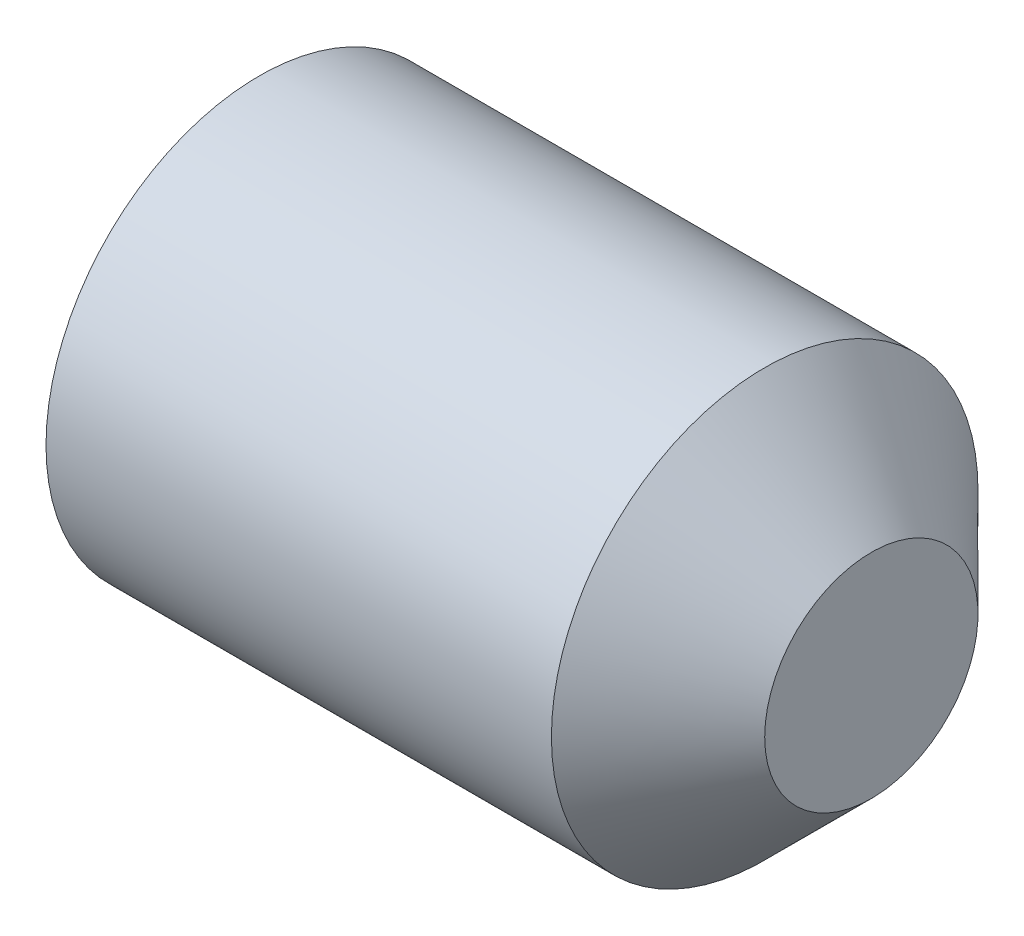
ISO-10303-21;
HEADER;
FILE_DESCRIPTION(('STEP AP214'),'2;1');
FILE_NAME('part.step','',(''),(''),'','','');
FILE_SCHEMA(('AUTOMOTIVE_DESIGN { 1 0 10303 214 1 1 1 1 }'));
ENDSEC;
DATA;
#1=APPLICATION_CONTEXT('core data for automotive mechanical design processes');
#2=APPLICATION_PROTOCOL_DEFINITION('international standard','automotive_design',2000,#1);
#3=PRODUCT_CONTEXT('',#1,'mechanical');
#4=PRODUCT('Part','Part','',(#3));
#5=PRODUCT_RELATED_PRODUCT_CATEGORY('part','',(#4));
#6=PRODUCT_DEFINITION_FORMATION('','',#4);
#7=PRODUCT_DEFINITION_CONTEXT('part definition',#1,'design');
#8=PRODUCT_DEFINITION('design','',#6,#7);
#9=PRODUCT_DEFINITION_SHAPE('','',#8);
#10=(LENGTH_UNIT() NAMED_UNIT(*) SI_UNIT(.MILLI.,.METRE.));
#11=(NAMED_UNIT(*) PLANE_ANGLE_UNIT() SI_UNIT($,.RADIAN.));
#12=(NAMED_UNIT(*) SI_UNIT($,.STERADIAN.) SOLID_ANGLE_UNIT());
#13=UNCERTAINTY_MEASURE_WITH_UNIT(LENGTH_MEASURE(1.E-05),#10,'distance_accuracy_value','');
#14=(GEOMETRIC_REPRESENTATION_CONTEXT(3) GLOBAL_UNCERTAINTY_ASSIGNED_CONTEXT((#13)) GLOBAL_UNIT_ASSIGNED_CONTEXT((#10,
#11,#12)) REPRESENTATION_CONTEXT('',''));
#15=CARTESIAN_POINT('',(0.,0.,0.));
#16=DIRECTION('',(0.,0.,1.));
#17=DIRECTION('',(1.,0.,0.));
#18=AXIS2_PLACEMENT_3D('',#15,#16,#17);
#19=CARTESIAN_POINT('',(0.,0.,0.));
#20=DIRECTION('',(-1.,0.,0.));
#21=DIRECTION('',(0.,0.,1.));
#22=AXIS2_PLACEMENT_3D('',#19,#20,#21);
#23=PLANE('',#22);
#24=CARTESIAN_POINT('',(0.,0.,0.));
#25=DIRECTION('',(-1.,0.,0.));
#26=DIRECTION('',(0.,0.,1.));
#27=AXIS2_PLACEMENT_3D('',#24,#25,#26);
#28=CIRCLE('',#27,0.774000000000001);
#29=CARTESIAN_POINT('',(0.,0.,0.774000000000001));
#30=VERTEX_POINT('',#29);
#31=EDGE_CURVE('E136',#30,#30,#28,.T.);
#32=ORIENTED_EDGE('',*,*,#31,.T.);
#33=EDGE_LOOP('',(#32));
#34=FACE_BOUND('',#33,.T.);
#35=DIRECTION('',(0.,0.,-1.));
#36=VECTOR('',#35,1.);
#37=CARTESIAN_POINT('',(0.,0.450000000000003,0.259807621135329));
#38=LINE('',#37,#36);
#39=CARTESIAN_POINT('',(0.,0.450000000000003,0.259807621135329));
#40=VERTEX_POINT('',#39);
#41=CARTESIAN_POINT('',(0.,0.450000000000003,-0.259807621135334));
#42=VERTEX_POINT('',#41);
#43=EDGE_CURVE('E127',#40,#42,#38,.T.);
#44=ORIENTED_EDGE('',*,*,#43,.F.);
#45=DIRECTION('',(0.,-0.866025403784439,0.5));
#46=VECTOR('',#45,1.);
#47=CARTESIAN_POINT('',(0.,0.450000000000003,0.259807621135329));
#48=LINE('',#47,#46);
#49=CARTESIAN_POINT('',(0.,0.,0.51961524227066));
#50=VERTEX_POINT('',#49);
#51=EDGE_CURVE('E49',#40,#50,#48,.T.);
#52=ORIENTED_EDGE('',*,*,#51,.T.);
#53=DIRECTION('',(0.,0.866025403784439,0.5));
#54=VECTOR('',#53,1.);
#55=CARTESIAN_POINT('',(0.,-0.449999999999997,0.259807621135329));
#56=LINE('',#55,#54);
#57=CARTESIAN_POINT('',(0.,-0.449999999999997,0.259807621135329));
#58=VERTEX_POINT('',#57);
#59=EDGE_CURVE('E118',#58,#50,#56,.T.);
#60=ORIENTED_EDGE('',*,*,#59,.F.);
#61=DIRECTION('',(0.,0.,-1.));
#62=VECTOR('',#61,1.);
#63=CARTESIAN_POINT('',(0.,-0.449999999999997,0.259807621135329));
#64=LINE('',#63,#62);
#65=CARTESIAN_POINT('',(0.,-0.449999999999997,-0.259807621135334));
#66=VERTEX_POINT('',#65);
#67=EDGE_CURVE('E121',#58,#66,#64,.T.);
#68=ORIENTED_EDGE('',*,*,#67,.T.);
#69=DIRECTION('',(0.,0.866025403784438,-0.500000000000001));
#70=VECTOR('',#69,1.);
#71=CARTESIAN_POINT('',(0.,-0.449999999999997,-0.259807621135334));
#72=LINE('',#71,#70);
#73=CARTESIAN_POINT('',(0.,0.,-0.519615242270666));
#74=VERTEX_POINT('',#73);
#75=EDGE_CURVE('E124',#66,#74,#72,.T.);
#76=ORIENTED_EDGE('',*,*,#75,.T.);
#77=DIRECTION('',(0.,-0.866025403784439,-0.5));
#78=VECTOR('',#77,1.);
#79=CARTESIAN_POINT('',(0.,0.450000000000003,-0.259807621135334));
#80=LINE('',#79,#78);
#81=EDGE_CURVE('E107',#42,#74,#80,.T.);
#82=ORIENTED_EDGE('',*,*,#81,.F.);
#83=EDGE_LOOP('',(#44,#52,#60,#68,#76,#82));
#84=FACE_BOUND('',#83,.T.);
#85=ADVANCED_FACE('F34',(#34,#84),#23,.T.);
#86=CARTESIAN_POINT('',(3.,0.5,0.));
#87=DIRECTION('',(1.,0.,0.));
#88=DIRECTION('',(0.,0.,-1.));
#89=AXIS2_PLACEMENT_3D('',#86,#87,#88);
#90=PLANE('',#89);
#91=CARTESIAN_POINT('',(3.,0.,0.));
#92=DIRECTION('',(-1.,0.,0.));
#93=DIRECTION('',(0.,0.,1.));
#94=AXIS2_PLACEMENT_3D('',#91,#92,#93);
#95=CIRCLE('',#94,0.5);
#96=CARTESIAN_POINT('',(3.,0.,0.5));
#97=VERTEX_POINT('',#96);
#98=EDGE_CURVE('E11',#97,#97,#95,.T.);
#99=ORIENTED_EDGE('',*,*,#98,.F.);
#100=EDGE_LOOP('',(#99));
#101=FACE_BOUND('',#100,.T.);
#102=ADVANCED_FACE('F36',(#101),#90,.T.);
#103=CARTESIAN_POINT('',(2.5,0.,0.));
#104=DIRECTION('',(-1.,0.,0.));
#105=DIRECTION('',(0.,0.,1.));
#106=AXIS2_PLACEMENT_3D('',#103,#104,#105);
#107=CONICAL_SURFACE('',#106,1.,0.785398163397451);
#108=ORIENTED_EDGE('',*,*,#98,.T.);
#109=EDGE_LOOP('',(#108));
#110=FACE_BOUND('',#109,.T.);
#111=CARTESIAN_POINT('',(2.5,0.,0.));
#112=DIRECTION('',(-1.,0.,0.));
#113=DIRECTION('',(0.,0.,1.));
#114=AXIS2_PLACEMENT_3D('',#111,#112,#113);
#115=CIRCLE('',#114,1.);
#116=CARTESIAN_POINT('',(2.5,0.,1.));
#117=VERTEX_POINT('',#116);
#118=EDGE_CURVE('E42',#117,#117,#115,.T.);
#119=ORIENTED_EDGE('',*,*,#118,.F.);
#120=EDGE_LOOP('',(#119));
#121=FACE_BOUND('',#120,.T.);
#122=ADVANCED_FACE('F147',(#110,#121),#107,.T.);
#123=CARTESIAN_POINT('',(-12.7,0.,0.));
#124=DIRECTION('',(-1.,0.,0.));
#125=DIRECTION('',(0.,0.,1.));
#126=AXIS2_PLACEMENT_3D('',#123,#124,#125);
#127=CYLINDRICAL_SURFACE('',#126,1.);
#128=ORIENTED_EDGE('',*,*,#118,.T.);
#129=EDGE_LOOP('',(#128));
#130=FACE_BOUND('',#129,.T.);
#131=CARTESIAN_POINT('',(0.130481160836854,0.,0.));
#132=DIRECTION('',(-1.,0.,0.));
#133=DIRECTION('',(0.,0.,1.));
#134=AXIS2_PLACEMENT_3D('',#131,#132,#133);
#135=CIRCLE('',#134,1.);
#136=CARTESIAN_POINT('',(0.130481160836854,0.,1.));
#137=VERTEX_POINT('',#136);
#138=EDGE_CURVE('E139',#137,#137,#135,.T.);
#139=ORIENTED_EDGE('',*,*,#138,.F.);
#140=EDGE_LOOP('',(#139));
#141=FACE_BOUND('',#140,.T.);
#142=ADVANCED_FACE('F144',(#130,#141),#127,.T.);
#143=CARTESIAN_POINT('',(0.,0.,0.));
#144=DIRECTION('',(1.,0.,0.));
#145=DIRECTION('',(0.,0.,-1.));
#146=AXIS2_PLACEMENT_3D('',#143,#144,#145);
#147=CONICAL_SURFACE('',#146,0.774000000000001,1.0471975511966);
#148=ORIENTED_EDGE('',*,*,#138,.T.);
#149=EDGE_LOOP('',(#148));
#150=FACE_BOUND('',#149,.T.);
#151=ORIENTED_EDGE('',*,*,#31,.F.);
#152=EDGE_LOOP('',(#151));
#153=FACE_BOUND('',#152,.T.);
#154=ADVANCED_FACE('F154',(#150,#153),#147,.T.);
#155=CARTESIAN_POINT('',(1.2,0.450000000000003,0.259807621135329));
#156=DIRECTION('',(0.,-0.5,-0.866025403784439));
#157=DIRECTION('',(0.,0.866025403784439,-0.5));
#158=AXIS2_PLACEMENT_3D('',#155,#156,#157);
#159=PLANE('',#158);
#160=ORIENTED_EDGE('',*,*,#51,.F.);
#161=DIRECTION('',(-1.,0.,0.));
#162=VECTOR('',#161,1.);
#163=CARTESIAN_POINT('',(1.2,0.450000000000003,0.259807621135329));
#164=LINE('',#163,#162);
#165=CARTESIAN_POINT('',(1.2,0.450000000000003,0.259807621135329));
#166=VERTEX_POINT('',#165);
#167=EDGE_CURVE('E54',#166,#40,#164,.T.);
#168=ORIENTED_EDGE('',*,*,#167,.F.);
#169=DIRECTION('',(0.,-0.866025403784439,0.5));
#170=VECTOR('',#169,1.);
#171=CARTESIAN_POINT('',(1.2,0.450000000000003,0.259807621135329));
#172=LINE('',#171,#170);
#173=CARTESIAN_POINT('',(1.2,0.,0.51961524227066));
#174=VERTEX_POINT('',#173);
#175=EDGE_CURVE('E81',#166,#174,#172,.T.);
#176=ORIENTED_EDGE('',*,*,#175,.T.);
#177=DIRECTION('',(-1.,0.,0.));
#178=VECTOR('',#177,1.);
#179=CARTESIAN_POINT('',(1.2,0.,0.51961524227066));
#180=LINE('',#179,#178);
#181=EDGE_CURVE('E134',#174,#50,#180,.T.);
#182=ORIENTED_EDGE('',*,*,#181,.T.);
#183=EDGE_LOOP('',(#160,#168,#176,#182));
#184=FACE_BOUND('',#183,.T.);
#185=ADVANCED_FACE('F165',(#184),#159,.T.);
#186=CARTESIAN_POINT('',(1.2,-0.449999999999997,0.259807621135329));
#187=DIRECTION('',(0.,-0.5,0.866025403784439));
#188=DIRECTION('',(0.,-0.866025403784439,-0.5));
#189=AXIS2_PLACEMENT_3D('',#186,#187,#188);
#190=PLANE('',#189);
#191=ORIENTED_EDGE('',*,*,#59,.T.);
#192=ORIENTED_EDGE('',*,*,#181,.F.);
#193=DIRECTION('',(0.,0.866025403784439,0.5));
#194=VECTOR('',#193,1.);
#195=CARTESIAN_POINT('',(1.2,-0.449999999999997,0.259807621135329));
#196=LINE('',#195,#194);
#197=CARTESIAN_POINT('',(1.2,-0.449999999999997,0.259807621135329));
#198=VERTEX_POINT('',#197);
#199=EDGE_CURVE('E267',#198,#174,#196,.T.);
#200=ORIENTED_EDGE('',*,*,#199,.F.);
#201=DIRECTION('',(-1.,0.,0.));
#202=VECTOR('',#201,1.);
#203=CARTESIAN_POINT('',(1.2,-0.449999999999997,0.259807621135329));
#204=LINE('',#203,#202);
#205=EDGE_CURVE('E132',#198,#58,#204,.T.);
#206=ORIENTED_EDGE('',*,*,#205,.T.);
#207=EDGE_LOOP('',(#191,#192,#200,#206));
#208=FACE_BOUND('',#207,.T.);
#209=ADVANCED_FACE('F172',(#208),#190,.F.);
#210=CARTESIAN_POINT('',(1.2,-0.449999999999997,0.259807621135329));
#211=DIRECTION('',(0.,1.,0.));
#212=DIRECTION('',(0.,0.,1.));
#213=AXIS2_PLACEMENT_3D('',#210,#211,#212);
#214=PLANE('',#213);
#215=ORIENTED_EDGE('',*,*,#67,.F.);
#216=ORIENTED_EDGE('',*,*,#205,.F.);
#217=DIRECTION('',(0.,0.,-1.));
#218=VECTOR('',#217,1.);
#219=CARTESIAN_POINT('',(1.2,-0.449999999999997,0.259807621135329));
#220=LINE('',#219,#218);
#221=CARTESIAN_POINT('',(1.2,-0.449999999999997,-0.259807621135334));
#222=VERTEX_POINT('',#221);
#223=EDGE_CURVE('E102',#198,#222,#220,.T.);
#224=ORIENTED_EDGE('',*,*,#223,.T.);
#225=DIRECTION('',(-1.,0.,0.));
#226=VECTOR('',#225,1.);
#227=CARTESIAN_POINT('',(1.2,-0.449999999999997,-0.259807621135334));
#228=LINE('',#227,#226);
#229=EDGE_CURVE('E97',#222,#66,#228,.T.);
#230=ORIENTED_EDGE('',*,*,#229,.T.);
#231=EDGE_LOOP('',(#215,#216,#224,#230));
#232=FACE_BOUND('',#231,.T.);
#233=ADVANCED_FACE('F179',(#232),#214,.T.);
#234=CARTESIAN_POINT('',(1.2,-0.449999999999997,-0.259807621135334));
#235=DIRECTION('',(0.,0.500000000000001,0.866025403784438));
#236=DIRECTION('',(0.,-0.866025403784438,0.500000000000001));
#237=AXIS2_PLACEMENT_3D('',#234,#235,#236);
#238=PLANE('',#237);
#239=ORIENTED_EDGE('',*,*,#75,.F.);
#240=ORIENTED_EDGE('',*,*,#229,.F.);
#241=DIRECTION('',(0.,0.866025403784438,-0.500000000000001));
#242=VECTOR('',#241,1.);
#243=CARTESIAN_POINT('',(1.2,-0.449999999999997,-0.259807621135334));
#244=LINE('',#243,#242);
#245=CARTESIAN_POINT('',(1.2,0.,-0.519615242270666));
#246=VERTEX_POINT('',#245);
#247=EDGE_CURVE('E92',#222,#246,#244,.T.);
#248=ORIENTED_EDGE('',*,*,#247,.T.);
#249=DIRECTION('',(-1.,0.,0.));
#250=VECTOR('',#249,1.);
#251=CARTESIAN_POINT('',(1.2,0.,-0.519615242270666));
#252=LINE('',#251,#250);
#253=EDGE_CURVE('E96',#246,#74,#252,.T.);
#254=ORIENTED_EDGE('',*,*,#253,.T.);
#255=EDGE_LOOP('',(#239,#240,#248,#254));
#256=FACE_BOUND('',#255,.T.);
#257=ADVANCED_FACE('F95',(#256),#238,.T.);
#258=CARTESIAN_POINT('',(1.2,0.450000000000003,-0.259807621135334));
#259=DIRECTION('',(0.,0.5,-0.866025403784439));
#260=DIRECTION('',(0.,0.866025403784439,0.5));
#261=AXIS2_PLACEMENT_3D('',#258,#259,#260);
#262=PLANE('',#261);
#263=ORIENTED_EDGE('',*,*,#81,.T.);
#264=ORIENTED_EDGE('',*,*,#253,.F.);
#265=DIRECTION('',(0.,-0.866025403784439,-0.5));
#266=VECTOR('',#265,1.);
#267=CARTESIAN_POINT('',(1.2,0.450000000000003,-0.259807621135334));
#268=LINE('',#267,#266);
#269=CARTESIAN_POINT('',(1.2,0.450000000000003,-0.259807621135334));
#270=VERTEX_POINT('',#269);
#271=EDGE_CURVE('E101',#270,#246,#268,.T.);
#272=ORIENTED_EDGE('',*,*,#271,.F.);
#273=DIRECTION('',(-1.,0.,0.));
#274=VECTOR('',#273,1.);
#275=CARTESIAN_POINT('',(1.2,0.450000000000003,-0.259807621135334));
#276=LINE('',#275,#274);
#277=EDGE_CURVE('E77',#270,#42,#276,.T.);
#278=ORIENTED_EDGE('',*,*,#277,.T.);
#279=EDGE_LOOP('',(#263,#264,#272,#278));
#280=FACE_BOUND('',#279,.T.);
#281=ADVANCED_FACE('F104',(#280),#262,.F.);
#282=CARTESIAN_POINT('',(1.2,0.450000000000003,0.259807621135329));
#283=DIRECTION('',(0.,1.,0.));
#284=DIRECTION('',(0.,0.,1.));
#285=AXIS2_PLACEMENT_3D('',#282,#283,#284);
#286=PLANE('',#285);
#287=ORIENTED_EDGE('',*,*,#43,.T.);
#288=ORIENTED_EDGE('',*,*,#277,.F.);
#289=DIRECTION('',(0.,0.,-1.));
#290=VECTOR('',#289,1.);
#291=CARTESIAN_POINT('',(1.2,0.450000000000003,0.259807621135329));
#292=LINE('',#291,#290);
#293=EDGE_CURVE('E112',#166,#270,#292,.T.);
#294=ORIENTED_EDGE('',*,*,#293,.F.);
#295=ORIENTED_EDGE('',*,*,#167,.T.);
#296=EDGE_LOOP('',(#287,#288,#294,#295));
#297=FACE_BOUND('',#296,.T.);
#298=ADVANCED_FACE('F191',(#297),#286,.F.);
#299=CARTESIAN_POINT('',(1.2,0.900000000000002,0.));
#300=DIRECTION('',(1.,0.,0.));
#301=DIRECTION('',(0.,0.,-1.));
#302=AXIS2_PLACEMENT_3D('',#299,#300,#301);
#303=PLANE('',#302);
#304=ORIENTED_EDGE('',*,*,#175,.F.);
#305=ORIENTED_EDGE('',*,*,#293,.T.);
#306=ORIENTED_EDGE('',*,*,#271,.T.);
#307=ORIENTED_EDGE('',*,*,#247,.F.);
#308=ORIENTED_EDGE('',*,*,#223,.F.);
#309=ORIENTED_EDGE('',*,*,#199,.T.);
#310=EDGE_LOOP('',(#304,#305,#306,#307,#308,#309));
#311=FACE_BOUND('',#310,.T.);
#312=ADVANCED_FACE('F110',(#311),#303,.F.);
#313=CLOSED_SHELL('',(#85,#102,#122,#142,#154,#185,#209,#233,#257,#281,#298,#312));
#314=MANIFOLD_SOLID_BREP('B2',#313);
#315=ADVANCED_BREP_SHAPE_REPRESENTATION('',(#18,#314),#14);
#316=SHAPE_DEFINITION_REPRESENTATION(#9,#315);
ENDSEC;
END-ISO-10303-21;
